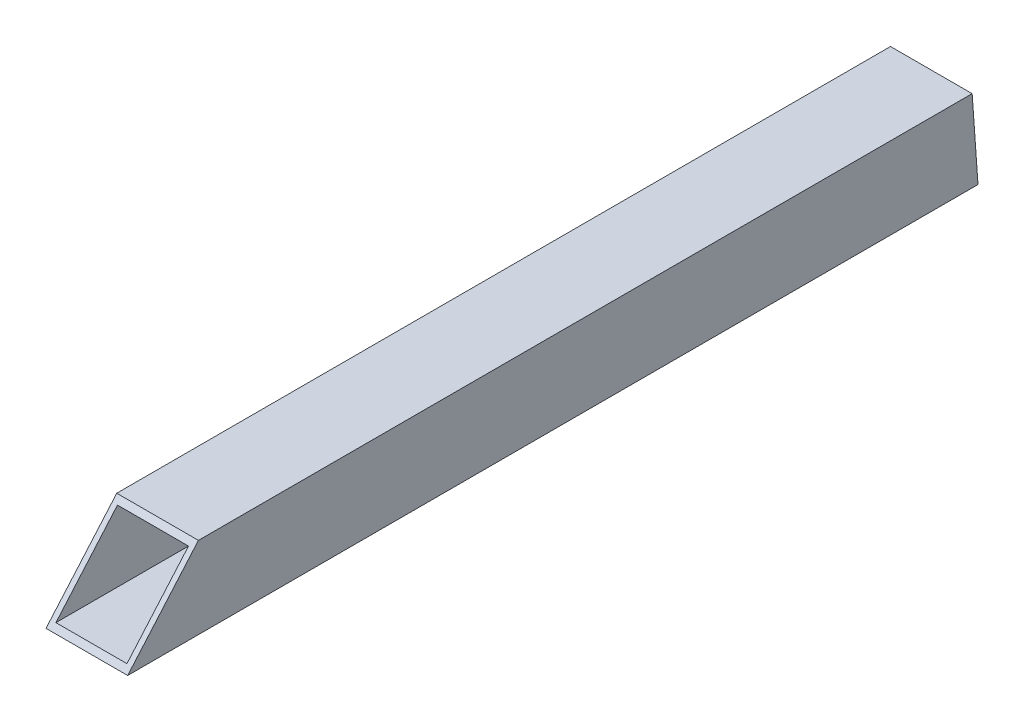
ISO-10303-21;
HEADER;
FILE_DESCRIPTION(('STEP AP214'),'2;1');
FILE_NAME('part.step','',(''),(''),'','','');
FILE_SCHEMA(('AUTOMOTIVE_DESIGN { 1 0 10303 214 1 1 1 1 }'));
ENDSEC;
DATA;
#1=APPLICATION_CONTEXT('core data for automotive mechanical design processes');
#2=APPLICATION_PROTOCOL_DEFINITION('international standard','automotive_design',2000,#1);
#3=PRODUCT_CONTEXT('',#1,'mechanical');
#4=PRODUCT('Part','Part','',(#3));
#5=PRODUCT_RELATED_PRODUCT_CATEGORY('part','',(#4));
#6=PRODUCT_DEFINITION_FORMATION('','',#4);
#7=PRODUCT_DEFINITION_CONTEXT('part definition',#1,'design');
#8=PRODUCT_DEFINITION('design','',#6,#7);
#9=PRODUCT_DEFINITION_SHAPE('','',#8);
#10=(LENGTH_UNIT() NAMED_UNIT(*) SI_UNIT(.MILLI.,.METRE.));
#11=(NAMED_UNIT(*) PLANE_ANGLE_UNIT() SI_UNIT($,.RADIAN.));
#12=(NAMED_UNIT(*) SI_UNIT($,.STERADIAN.) SOLID_ANGLE_UNIT());
#13=UNCERTAINTY_MEASURE_WITH_UNIT(LENGTH_MEASURE(1.E-05),#10,'distance_accuracy_value','');
#14=(GEOMETRIC_REPRESENTATION_CONTEXT(3) GLOBAL_UNCERTAINTY_ASSIGNED_CONTEXT((#13)) GLOBAL_UNIT_ASSIGNED_CONTEXT((#10,
#11,#12)) REPRESENTATION_CONTEXT('',''));
#15=CARTESIAN_POINT('',(0.,0.,0.));
#16=DIRECTION('',(0.,0.,1.));
#17=DIRECTION('',(1.,0.,0.));
#18=AXIS2_PLACEMENT_3D('',#15,#16,#17);
#19=CARTESIAN_POINT('',(-12.7,12.7,252.578999999999));
#20=DIRECTION('',(1.,0.,0.));
#21=DIRECTION('',(0.,0.,-1.));
#22=AXIS2_PLACEMENT_3D('',#19,#20,#21);
#23=PLANE('',#22);
#24=DIRECTION('',(0.,0.997447018462014,0.0714104009317899));
#25=VECTOR('',#24,1.);
#26=CARTESIAN_POINT('',(-12.7,29.3513500890115,2.10135640184425));
#27=LINE('',#26,#25);
#28=CARTESIAN_POINT('',(-12.7,-12.7,-0.909233347784371));
#29=VERTEX_POINT('',#28);
#30=CARTESIAN_POINT('',(-12.7,12.7,0.909233347784311));
#31=VERTEX_POINT('',#30);
#32=EDGE_CURVE('E47',#29,#31,#27,.T.);
#33=ORIENTED_EDGE('',*,*,#32,.F.);
#34=DIRECTION('',(0.,0.,-1.));
#35=VECTOR('',#34,1.);
#36=CARTESIAN_POINT('',(-12.7,-12.7,252.578999999999));
#37=LINE('',#36,#35);
#38=CARTESIAN_POINT('',(-12.7,-12.7,263.582025126873));
#39=VERTEX_POINT('',#38);
#40=EDGE_CURVE('E108',#39,#29,#37,.T.);
#41=ORIENTED_EDGE('',*,*,#40,.F.);
#42=DIRECTION('',(0.,-0.755796329374887,0.654806771882703));
#43=VECTOR('',#42,1.);
#44=CARTESIAN_POINT('',(-12.7,42.1917776561932,216.024890574918));
#45=LINE('',#44,#43);
#46=CARTESIAN_POINT('',(-12.7,12.7,241.575974873127));
#47=VERTEX_POINT('',#46);
#48=EDGE_CURVE('E102',#47,#39,#45,.T.);
#49=ORIENTED_EDGE('',*,*,#48,.F.);
#50=DIRECTION('',(0.,0.,-1.));
#51=VECTOR('',#50,1.);
#52=CARTESIAN_POINT('',(-12.7,12.7,252.578999999999));
#53=LINE('',#52,#51);
#54=EDGE_CURVE('E110',#47,#31,#53,.T.);
#55=ORIENTED_EDGE('',*,*,#54,.T.);
#56=EDGE_LOOP('',(#33,#41,#49,#55));
#57=FACE_BOUND('',#56,.T.);
#58=ADVANCED_FACE('F33',(#57),#23,.F.);
#59=CARTESIAN_POINT('',(12.7,-12.7,252.578999999999));
#60=DIRECTION('',(0.,1.,0.));
#61=DIRECTION('',(-1.,0.,0.));
#62=AXIS2_PLACEMENT_3D('',#59,#60,#61);
#63=PLANE('',#62);
#64=DIRECTION('',(-1.,0.,0.));
#65=VECTOR('',#64,1.);
#66=CARTESIAN_POINT('',(12.7,-12.7,-0.909233347784366));
#67=LINE('',#66,#65);
#68=CARTESIAN_POINT('',(12.7,-12.7,-0.909233347784444));
#69=VERTEX_POINT('',#68);
#70=EDGE_CURVE('E94',#69,#29,#67,.T.);
#71=ORIENTED_EDGE('',*,*,#70,.F.);
#72=DIRECTION('',(0.,0.,-1.));
#73=VECTOR('',#72,1.);
#74=CARTESIAN_POINT('',(12.7,-12.7,252.578999999999));
#75=LINE('',#74,#73);
#76=CARTESIAN_POINT('',(12.7,-12.7,263.582025126873));
#77=VERTEX_POINT('',#76);
#78=EDGE_CURVE('E115',#77,#69,#75,.T.);
#79=ORIENTED_EDGE('',*,*,#78,.F.);
#80=DIRECTION('',(1.,0.,0.));
#81=VECTOR('',#80,1.);
#82=CARTESIAN_POINT('',(12.7,-12.7,263.582025126873));
#83=LINE('',#82,#81);
#84=EDGE_CURVE('E114',#39,#77,#83,.T.);
#85=ORIENTED_EDGE('',*,*,#84,.F.);
#86=ORIENTED_EDGE('',*,*,#40,.T.);
#87=EDGE_LOOP('',(#71,#79,#85,#86));
#88=FACE_BOUND('',#87,.T.);
#89=ADVANCED_FACE('F113',(#88),#63,.F.);
#90=CARTESIAN_POINT('',(12.7,12.7,252.578999999999));
#91=DIRECTION('',(-1.,0.,0.));
#92=DIRECTION('',(0.,-1.,0.));
#93=AXIS2_PLACEMENT_3D('',#90,#91,#92);
#94=PLANE('',#93);
#95=DIRECTION('',(0.,-0.997447018462014,-0.0714104009317899));
#96=VECTOR('',#95,1.);
#97=CARTESIAN_POINT('',(12.7,30.6259571660296,2.19260957190298));
#98=LINE('',#97,#96);
#99=CARTESIAN_POINT('',(12.7,12.7,0.909233347784311));
#100=VERTEX_POINT('',#99);
#101=EDGE_CURVE('E97',#100,#69,#98,.T.);
#102=ORIENTED_EDGE('',*,*,#101,.F.);
#103=DIRECTION('',(0.,0.,-1.));
#104=VECTOR('',#103,1.);
#105=CARTESIAN_POINT('',(12.7,12.7,252.578999999999));
#106=LINE('',#105,#104);
#107=CARTESIAN_POINT('',(12.7,12.7,241.575974873127));
#108=VERTEX_POINT('',#107);
#109=EDGE_CURVE('E118',#108,#100,#106,.T.);
#110=ORIENTED_EDGE('',*,*,#109,.F.);
#111=DIRECTION('',(0.,0.755796329374888,-0.654806771882703));
#112=VECTOR('',#111,1.);
#113=CARTESIAN_POINT('',(12.7,7.25459676200677,246.293762956087));
#114=LINE('',#113,#112);
#115=EDGE_CURVE('E137',#77,#108,#114,.T.);
#116=ORIENTED_EDGE('',*,*,#115,.F.);
#117=ORIENTED_EDGE('',*,*,#78,.T.);
#118=EDGE_LOOP('',(#102,#110,#116,#117));
#119=FACE_BOUND('',#118,.T.);
#120=ADVANCED_FACE('F185',(#119),#94,.F.);
#121=CARTESIAN_POINT('',(12.7,12.7,252.578999999999));
#122=DIRECTION('',(0.,-1.,0.));
#123=DIRECTION('',(1.,0.,0.));
#124=AXIS2_PLACEMENT_3D('',#121,#122,#123);
#125=PLANE('',#124);
#126=DIRECTION('',(1.,0.,0.));
#127=VECTOR('',#126,1.);
#128=CARTESIAN_POINT('',(12.7,12.7,0.909233347784311));
#129=LINE('',#128,#127);
#130=EDGE_CURVE('E152',#31,#100,#129,.T.);
#131=ORIENTED_EDGE('',*,*,#130,.F.);
#132=ORIENTED_EDGE('',*,*,#54,.F.);
#133=DIRECTION('',(-1.,0.,0.));
#134=VECTOR('',#133,1.);
#135=CARTESIAN_POINT('',(12.7,12.7,241.575974873127));
#136=LINE('',#135,#134);
#137=EDGE_CURVE('E139',#108,#47,#136,.T.);
#138=ORIENTED_EDGE('',*,*,#137,.F.);
#139=ORIENTED_EDGE('',*,*,#109,.T.);
#140=EDGE_LOOP('',(#131,#132,#138,#139));
#141=FACE_BOUND('',#140,.T.);
#142=ADVANCED_FACE('F189',(#141),#125,.F.);
#143=CARTESIAN_POINT('',(-11.049,11.049,252.578999999999));
#144=DIRECTION('',(1.,0.,0.));
#145=DIRECTION('',(0.,1.,0.));
#146=AXIS2_PLACEMENT_3D('',#143,#144,#145);
#147=PLANE('',#146);
#148=DIRECTION('',(0.,0.,-1.));
#149=VECTOR('',#148,1.);
#150=CARTESIAN_POINT('',(-11.049,-11.049,252.578999999999));
#151=LINE('',#150,#149);
#152=CARTESIAN_POINT('',(-11.049,-11.049,262.15163186038));
#153=VERTEX_POINT('',#152);
#154=CARTESIAN_POINT('',(-11.049,-11.049,-0.791033012572441));
#155=VERTEX_POINT('',#154);
#156=EDGE_CURVE('E124',#153,#155,#151,.T.);
#157=ORIENTED_EDGE('',*,*,#156,.T.);
#158=DIRECTION('',(0.,0.997447018462014,0.0714104009317899));
#159=VECTOR('',#158,1.);
#160=CARTESIAN_POINT('',(-11.049,28.983376350321,2.07501199284216));
#161=LINE('',#160,#159);
#162=CARTESIAN_POINT('',(-11.049,11.049,0.791033012572328));
#163=VERTEX_POINT('',#162);
#164=EDGE_CURVE('E154',#155,#163,#161,.T.);
#165=ORIENTED_EDGE('',*,*,#164,.T.);
#166=DIRECTION('',(0.,0.,-1.));
#167=VECTOR('',#166,1.);
#168=CARTESIAN_POINT('',(-11.049,11.049,252.578999999999));
#169=LINE('',#168,#167);
#170=CARTESIAN_POINT('',(-11.049,11.049,243.00636813962));
#171=VERTEX_POINT('',#170);
#172=EDGE_CURVE('E133',#171,#163,#169,.T.);
#173=ORIENTED_EDGE('',*,*,#172,.F.);
#174=DIRECTION('',(0.,-0.755796329374888,0.654806771882703));
#175=VECTOR('',#174,1.);
#176=CARTESIAN_POINT('',(-11.049,6.31149918294595,247.110843771796));
#177=LINE('',#176,#175);
#178=EDGE_CURVE('E141',#171,#153,#177,.T.);
#179=ORIENTED_EDGE('',*,*,#178,.T.);
#180=EDGE_LOOP('',(#157,#165,#173,#179));
#181=FACE_BOUND('',#180,.T.);
#182=ADVANCED_FACE('F172',(#181),#147,.T.);
#183=CARTESIAN_POINT('',(11.049,-11.049,252.578999999999));
#184=DIRECTION('',(0.,1.,0.));
#185=DIRECTION('',(-1.,0.,0.));
#186=AXIS2_PLACEMENT_3D('',#183,#184,#185);
#187=PLANE('',#186);
#188=DIRECTION('',(0.,0.,-1.));
#189=VECTOR('',#188,1.);
#190=CARTESIAN_POINT('',(11.049,-11.049,252.578999999999));
#191=LINE('',#190,#189);
#192=CARTESIAN_POINT('',(11.049,-11.049,262.15163186038));
#193=VERTEX_POINT('',#192);
#194=CARTESIAN_POINT('',(11.049,-11.049,-0.791033012572431));
#195=VERTEX_POINT('',#194);
#196=EDGE_CURVE('E127',#193,#195,#191,.T.);
#197=ORIENTED_EDGE('',*,*,#196,.T.);
#198=DIRECTION('',(-1.,0.,0.));
#199=VECTOR('',#198,1.);
#200=CARTESIAN_POINT('',(11.049,-11.049,-0.79103301257244));
#201=LINE('',#200,#199);
#202=EDGE_CURVE('E157',#195,#155,#201,.T.);
#203=ORIENTED_EDGE('',*,*,#202,.T.);
#204=ORIENTED_EDGE('',*,*,#156,.F.);
#205=DIRECTION('',(1.,0.,0.));
#206=VECTOR('',#205,1.);
#207=CARTESIAN_POINT('',(11.049,-11.049,262.15163186038));
#208=LINE('',#207,#206);
#209=EDGE_CURVE('E144',#153,#193,#208,.T.);
#210=ORIENTED_EDGE('',*,*,#209,.T.);
#211=EDGE_LOOP('',(#197,#203,#204,#210));
#212=FACE_BOUND('',#211,.T.);
#213=ADVANCED_FACE('F165',(#212),#187,.T.);
#214=CARTESIAN_POINT('',(11.049,11.049,252.578999999999));
#215=DIRECTION('',(-1.,0.,0.));
#216=DIRECTION('',(0.,-1.,0.));
#217=AXIS2_PLACEMENT_3D('',#214,#215,#216);
#218=PLANE('',#217);
#219=DIRECTION('',(0.,0.,-1.));
#220=VECTOR('',#219,1.);
#221=CARTESIAN_POINT('',(11.049,11.049,252.578999999999));
#222=LINE('',#221,#220);
#223=CARTESIAN_POINT('',(11.049,11.049,243.00636813962));
#224=VERTEX_POINT('',#223);
#225=CARTESIAN_POINT('',(11.049,11.049,0.791033012572329));
#226=VERTEX_POINT('',#225);
#227=EDGE_CURVE('E130',#224,#226,#222,.T.);
#228=ORIENTED_EDGE('',*,*,#227,.T.);
#229=DIRECTION('',(0.,-0.997447018462014,-0.0714104009317899));
#230=VECTOR('',#229,1.);
#231=CARTESIAN_POINT('',(11.049,28.983376350321,2.07501199284216));
#232=LINE('',#231,#230);
#233=EDGE_CURVE('E55',#226,#195,#232,.T.);
#234=ORIENTED_EDGE('',*,*,#233,.T.);
#235=ORIENTED_EDGE('',*,*,#196,.F.);
#236=DIRECTION('',(0.,0.755796329374888,-0.654806771882703));
#237=VECTOR('',#236,1.);
#238=CARTESIAN_POINT('',(11.049,6.31149918294595,247.110843771796));
#239=LINE('',#238,#237);
#240=EDGE_CURVE('E147',#193,#224,#239,.T.);
#241=ORIENTED_EDGE('',*,*,#240,.T.);
#242=EDGE_LOOP('',(#228,#234,#235,#241));
#243=FACE_BOUND('',#242,.T.);
#244=ADVANCED_FACE('F162',(#243),#218,.T.);
#245=CARTESIAN_POINT('',(11.049,11.049,252.578999999999));
#246=DIRECTION('',(0.,-1.,0.));
#247=DIRECTION('',(1.,0.,0.));
#248=AXIS2_PLACEMENT_3D('',#245,#246,#247);
#249=PLANE('',#248);
#250=ORIENTED_EDGE('',*,*,#172,.T.);
#251=DIRECTION('',(1.,0.,0.));
#252=VECTOR('',#251,1.);
#253=CARTESIAN_POINT('',(11.049,11.049,0.791033012572329));
#254=LINE('',#253,#252);
#255=EDGE_CURVE('E11',#163,#226,#254,.T.);
#256=ORIENTED_EDGE('',*,*,#255,.T.);
#257=ORIENTED_EDGE('',*,*,#227,.F.);
#258=DIRECTION('',(-1.,0.,0.));
#259=VECTOR('',#258,1.);
#260=CARTESIAN_POINT('',(11.049,11.049,243.00636813962));
#261=LINE('',#260,#259);
#262=EDGE_CURVE('E40',#224,#171,#261,.T.);
#263=ORIENTED_EDGE('',*,*,#262,.T.);
#264=EDGE_LOOP('',(#250,#256,#257,#263));
#265=FACE_BOUND('',#264,.T.);
#266=ADVANCED_FACE('F174',(#265),#249,.T.);
#267=CARTESIAN_POINT('',(-12.7,42.1917776561932,216.024890574918));
#268=DIRECTION('',(0.,0.654806771882703,0.755796329374887));
#269=DIRECTION('',(0.,-0.755796329374888,0.654806771882703));
#270=AXIS2_PLACEMENT_3D('',#267,#268,#269);
#271=PLANE('',#270);
#272=ORIENTED_EDGE('',*,*,#262,.F.);
#273=ORIENTED_EDGE('',*,*,#240,.F.);
#274=ORIENTED_EDGE('',*,*,#209,.F.);
#275=ORIENTED_EDGE('',*,*,#178,.F.);
#276=EDGE_LOOP('',(#272,#273,#274,#275));
#277=FACE_BOUND('',#276,.T.);
#278=ORIENTED_EDGE('',*,*,#84,.T.);
#279=ORIENTED_EDGE('',*,*,#115,.T.);
#280=ORIENTED_EDGE('',*,*,#137,.T.);
#281=ORIENTED_EDGE('',*,*,#48,.T.);
#282=EDGE_LOOP('',(#278,#279,#280,#281));
#283=FACE_BOUND('',#282,.T.);
#284=ADVANCED_FACE('F168',(#277,#283),#271,.T.);
#285=CARTESIAN_POINT('',(-12.7,29.3513500890115,2.10135640184425));
#286=DIRECTION('',(0.,0.0714104009317899,-0.997447018462014));
#287=DIRECTION('',(0.,0.997447018462014,0.0714104009317899));
#288=AXIS2_PLACEMENT_3D('',#285,#286,#287);
#289=PLANE('',#288);
#290=ORIENTED_EDGE('',*,*,#202,.F.);
#291=ORIENTED_EDGE('',*,*,#233,.F.);
#292=ORIENTED_EDGE('',*,*,#255,.F.);
#293=ORIENTED_EDGE('',*,*,#164,.F.);
#294=EDGE_LOOP('',(#290,#291,#292,#293));
#295=FACE_BOUND('',#294,.T.);
#296=ORIENTED_EDGE('',*,*,#70,.T.);
#297=ORIENTED_EDGE('',*,*,#32,.T.);
#298=ORIENTED_EDGE('',*,*,#130,.T.);
#299=ORIENTED_EDGE('',*,*,#101,.T.);
#300=EDGE_LOOP('',(#296,#297,#298,#299));
#301=FACE_BOUND('',#300,.T.);
#302=ADVANCED_FACE('F95',(#295,#301),#289,.T.);
#303=CLOSED_SHELL('',(#58,#89,#120,#142,#182,#213,#244,#266,#284,#302));
#304=MANIFOLD_SOLID_BREP('B2',#303);
#305=ADVANCED_BREP_SHAPE_REPRESENTATION('',(#18,#304),#14);
#306=SHAPE_DEFINITION_REPRESENTATION(#9,#305);
ENDSEC;
END-ISO-10303-21;
